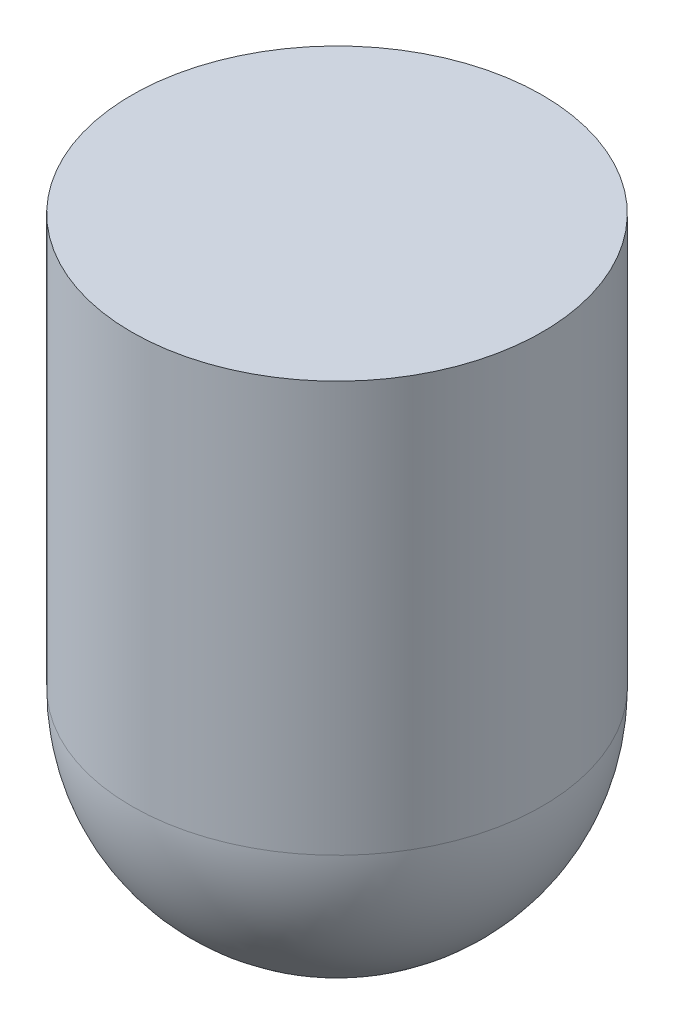
ISO-10303-21;
HEADER;
FILE_DESCRIPTION(('STEP AP214'),'2;1');
FILE_NAME('part.step','',(''),(''),'','','');
FILE_SCHEMA(('AUTOMOTIVE_DESIGN { 1 0 10303 214 1 1 1 1 }'));
ENDSEC;
DATA;
#1=APPLICATION_CONTEXT('core data for automotive mechanical design processes');
#2=APPLICATION_PROTOCOL_DEFINITION('international standard','automotive_design',2000,#1);
#3=PRODUCT_CONTEXT('',#1,'mechanical');
#4=PRODUCT('Part','Part','',(#3));
#5=PRODUCT_RELATED_PRODUCT_CATEGORY('part','',(#4));
#6=PRODUCT_DEFINITION_FORMATION('','',#4);
#7=PRODUCT_DEFINITION_CONTEXT('part definition',#1,'design');
#8=PRODUCT_DEFINITION('design','',#6,#7);
#9=PRODUCT_DEFINITION_SHAPE('','',#8);
#10=(LENGTH_UNIT() NAMED_UNIT(*) SI_UNIT(.MILLI.,.METRE.));
#11=(NAMED_UNIT(*) PLANE_ANGLE_UNIT() SI_UNIT($,.RADIAN.));
#12=(NAMED_UNIT(*) SI_UNIT($,.STERADIAN.) SOLID_ANGLE_UNIT());
#13=UNCERTAINTY_MEASURE_WITH_UNIT(LENGTH_MEASURE(1.E-05),#10,'distance_accuracy_value','');
#14=(GEOMETRIC_REPRESENTATION_CONTEXT(3) GLOBAL_UNCERTAINTY_ASSIGNED_CONTEXT((#13)) GLOBAL_UNIT_ASSIGNED_CONTEXT((#10,
#11,#12)) REPRESENTATION_CONTEXT('',''));
#15=CARTESIAN_POINT('',(0.,0.,0.));
#16=DIRECTION('',(0.,0.,1.));
#17=DIRECTION('',(1.,0.,0.));
#18=AXIS2_PLACEMENT_3D('',#15,#16,#17);
#19=CARTESIAN_POINT('',(0.,100.,0.));
#20=DIRECTION('',(0.,-1.,0.));
#21=DIRECTION('',(0.,0.,-1.));
#22=AXIS2_PLACEMENT_3D('',#19,#20,#21);
#23=CYLINDRICAL_SURFACE('',#22,50.);
#24=CARTESIAN_POINT('',(0.,100.,0.));
#25=DIRECTION('',(0.,1.,0.));
#26=DIRECTION('',(0.,0.,1.));
#27=AXIS2_PLACEMENT_3D('',#24,#25,#26);
#28=CIRCLE('',#27,50.);
#29=CARTESIAN_POINT('',(0.,100.,50.));
#30=VERTEX_POINT('',#29);
#31=EDGE_CURVE('E10',#30,#30,#28,.T.);
#32=ORIENTED_EDGE('',*,*,#31,.F.);
#33=EDGE_LOOP('',(#32));
#34=FACE_BOUND('',#33,.T.);
#35=CARTESIAN_POINT('',(0.,0.,0.));
#36=DIRECTION('',(0.,1.,0.));
#37=DIRECTION('',(0.,0.,1.));
#38=AXIS2_PLACEMENT_3D('',#35,#36,#37);
#39=CIRCLE('',#38,50.);
#40=CARTESIAN_POINT('',(0.,0.,50.));
#41=VERTEX_POINT('',#40);
#42=EDGE_CURVE('E37',#41,#41,#39,.T.);
#43=ORIENTED_EDGE('',*,*,#42,.T.);
#44=EDGE_LOOP('',(#43));
#45=FACE_BOUND('',#44,.T.);
#46=ADVANCED_FACE('F31',(#34,#45),#23,.T.);
#47=CARTESIAN_POINT('',(0.,100.,0.));
#48=DIRECTION('',(0.,1.,0.));
#49=DIRECTION('',(0.,0.,1.));
#50=AXIS2_PLACEMENT_3D('',#47,#48,#49);
#51=PLANE('',#50);
#52=ORIENTED_EDGE('',*,*,#31,.T.);
#53=EDGE_LOOP('',(#52));
#54=FACE_BOUND('',#53,.T.);
#55=ADVANCED_FACE('F46',(#54),#51,.T.);
#56=CARTESIAN_POINT('',(0.,0.,0.));
#57=DIRECTION('',(0.,1.,0.));
#58=DIRECTION('',(0.,0.,1.));
#59=AXIS2_PLACEMENT_3D('',#56,#57,#58);
#60=SPHERICAL_SURFACE('',#59,50.);
#61=ORIENTED_EDGE('',*,*,#42,.F.);
#62=EDGE_LOOP('',(#61));
#63=FACE_BOUND('',#62,.T.);
#64=ADVANCED_FACE('F44',(#63),#60,.T.);
#65=CLOSED_SHELL('',(#46,#55,#64));
#66=MANIFOLD_SOLID_BREP('B2',#65);
#67=ADVANCED_BREP_SHAPE_REPRESENTATION('',(#18,#66),#14);
#68=SHAPE_DEFINITION_REPRESENTATION(#9,#67);
ENDSEC;
END-ISO-10303-21;
